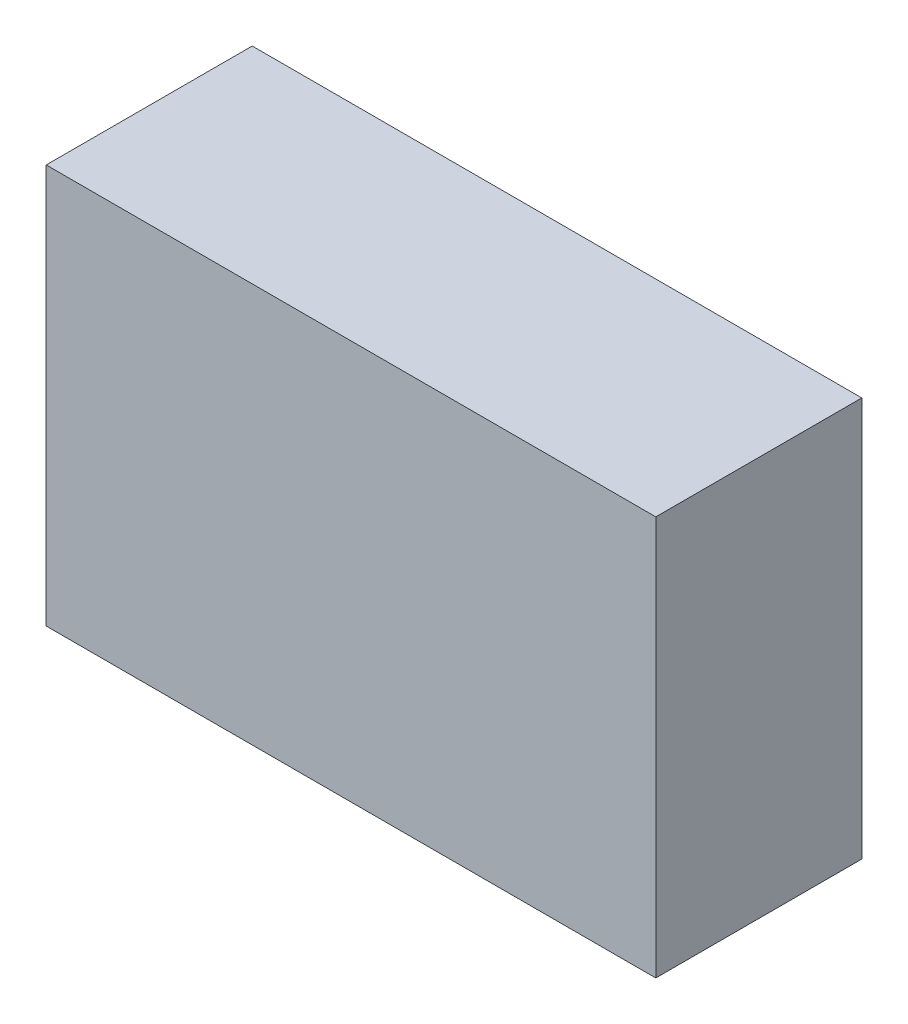
ISO-10303-21;
HEADER;
FILE_DESCRIPTION(('STEP AP214'),'2;1');
FILE_NAME('part.step','',(''),(''),'','','');
FILE_SCHEMA(('AUTOMOTIVE_DESIGN { 1 0 10303 214 1 1 1 1 }'));
ENDSEC;
DATA;
#1=APPLICATION_CONTEXT('core data for automotive mechanical design processes');
#2=APPLICATION_PROTOCOL_DEFINITION('international standard','automotive_design',2000,#1);
#3=PRODUCT_CONTEXT('',#1,'mechanical');
#4=PRODUCT('Part','Part','',(#3));
#5=PRODUCT_RELATED_PRODUCT_CATEGORY('part','',(#4));
#6=PRODUCT_DEFINITION_FORMATION('','',#4);
#7=PRODUCT_DEFINITION_CONTEXT('part definition',#1,'design');
#8=PRODUCT_DEFINITION('design','',#6,#7);
#9=PRODUCT_DEFINITION_SHAPE('','',#8);
#10=(LENGTH_UNIT() NAMED_UNIT(*) SI_UNIT(.MILLI.,.METRE.));
#11=(NAMED_UNIT(*) PLANE_ANGLE_UNIT() SI_UNIT($,.RADIAN.));
#12=(NAMED_UNIT(*) SI_UNIT($,.STERADIAN.) SOLID_ANGLE_UNIT());
#13=UNCERTAINTY_MEASURE_WITH_UNIT(LENGTH_MEASURE(1.E-05),#10,'distance_accuracy_value','');
#14=(GEOMETRIC_REPRESENTATION_CONTEXT(3) GLOBAL_UNCERTAINTY_ASSIGNED_CONTEXT((#13)) GLOBAL_UNIT_ASSIGNED_CONTEXT((#10,
#11,#12)) REPRESENTATION_CONTEXT('',''));
#15=CARTESIAN_POINT('',(0.,0.,0.));
#16=DIRECTION('',(0.,0.,1.));
#17=DIRECTION('',(1.,0.,0.));
#18=AXIS2_PLACEMENT_3D('',#15,#16,#17);
#19=CARTESIAN_POINT('',(-1.44999964,0.95000064,0.98000058));
#20=DIRECTION('',(0.,0.,1.));
#21=DIRECTION('',(1.,0.,0.));
#22=AXIS2_PLACEMENT_3D('',#19,#20,#21);
#23=PLANE('',#22);
#24=DIRECTION('',(0.,1.,0.));
#25=VECTOR('',#24,1.);
#26=CARTESIAN_POINT('',(1.44999964,0.95000064,0.98000058));
#27=LINE('',#26,#25);
#28=CARTESIAN_POINT('',(1.44999964,0.95000064,0.98000058));
#29=VERTEX_POINT('',#28);
#30=CARTESIAN_POINT('',(1.44999964,-0.95000064,0.98000058));
#31=VERTEX_POINT('',#30);
#32=EDGE_CURVE('E53',#29,#31,#27,.F.);
#33=ORIENTED_EDGE('',*,*,#32,.F.);
#34=DIRECTION('',(1.,0.,0.));
#35=VECTOR('',#34,1.);
#36=CARTESIAN_POINT('',(-1.44999964,0.95000064,0.98000058));
#37=LINE('',#36,#35);
#38=CARTESIAN_POINT('',(-1.44999964,0.95000064,0.98000058));
#39=VERTEX_POINT('',#38);
#40=EDGE_CURVE('E68',#39,#29,#37,.T.);
#41=ORIENTED_EDGE('',*,*,#40,.F.);
#42=DIRECTION('',(0.,1.,0.));
#43=VECTOR('',#42,1.);
#44=CARTESIAN_POINT('',(-1.44999964,-0.95000064,0.98000058));
#45=LINE('',#44,#43);
#46=CARTESIAN_POINT('',(-1.44999964,-0.95000064,0.98000058));
#47=VERTEX_POINT('',#46);
#48=EDGE_CURVE('E20',#47,#39,#45,.T.);
#49=ORIENTED_EDGE('',*,*,#48,.F.);
#50=DIRECTION('',(1.,0.,0.));
#51=VECTOR('',#50,1.);
#52=CARTESIAN_POINT('',(1.44999964,-0.95000064,0.98000058));
#53=LINE('',#52,#51);
#54=EDGE_CURVE('E58',#31,#47,#53,.F.);
#55=ORIENTED_EDGE('',*,*,#54,.F.);
#56=EDGE_LOOP('',(#33,#41,#49,#55));
#57=FACE_BOUND('',#56,.T.);
#58=ADVANCED_FACE('F17',(#57),#23,.T.);
#59=CARTESIAN_POINT('',(-1.44999964,-0.95000064,0.));
#60=DIRECTION('',(-1.,0.,0.));
#61=DIRECTION('',(0.,0.,1.));
#62=AXIS2_PLACEMENT_3D('',#59,#60,#61);
#63=PLANE('',#62);
#64=DIRECTION('',(0.,0.,1.));
#65=VECTOR('',#64,1.);
#66=CARTESIAN_POINT('',(-1.44999964,0.95000064,0.));
#67=LINE('',#66,#65);
#68=CARTESIAN_POINT('',(-1.44999964,0.95000064,0.));
#69=VERTEX_POINT('',#68);
#70=EDGE_CURVE('E79',#69,#39,#67,.T.);
#71=ORIENTED_EDGE('',*,*,#70,.F.);
#72=DIRECTION('',(0.,1.,0.));
#73=VECTOR('',#72,1.);
#74=CARTESIAN_POINT('',(-1.44999964,0.95000064,0.));
#75=LINE('',#74,#73);
#76=CARTESIAN_POINT('',(-1.44999964,-0.95000064,0.));
#77=VERTEX_POINT('',#76);
#78=EDGE_CURVE('E74',#69,#77,#75,.F.);
#79=ORIENTED_EDGE('',*,*,#78,.T.);
#80=DIRECTION('',(0.,0.,-1.));
#81=VECTOR('',#80,1.);
#82=CARTESIAN_POINT('',(-1.44999964,-0.95000064,0.));
#83=LINE('',#82,#81);
#84=EDGE_CURVE('E63',#47,#77,#83,.T.);
#85=ORIENTED_EDGE('',*,*,#84,.F.);
#86=ORIENTED_EDGE('',*,*,#48,.T.);
#87=EDGE_LOOP('',(#71,#79,#85,#86));
#88=FACE_BOUND('',#87,.T.);
#89=ADVANCED_FACE('F73',(#88),#63,.T.);
#90=CARTESIAN_POINT('',(1.44999964,-0.95000064,0.));
#91=DIRECTION('',(0.,-1.,0.));
#92=DIRECTION('',(0.,0.,-1.));
#93=AXIS2_PLACEMENT_3D('',#90,#91,#92);
#94=PLANE('',#93);
#95=ORIENTED_EDGE('',*,*,#84,.T.);
#96=DIRECTION('',(1.,0.,0.));
#97=VECTOR('',#96,1.);
#98=CARTESIAN_POINT('',(-1.44999964,-0.95000064,0.));
#99=LINE('',#98,#97);
#100=CARTESIAN_POINT('',(1.44999964,-0.95000064,0.));
#101=VERTEX_POINT('',#100);
#102=EDGE_CURVE('E84',#77,#101,#99,.T.);
#103=ORIENTED_EDGE('',*,*,#102,.T.);
#104=DIRECTION('',(0.,0.,-1.));
#105=VECTOR('',#104,1.);
#106=CARTESIAN_POINT('',(1.44999964,-0.95000064,0.));
#107=LINE('',#106,#105);
#108=EDGE_CURVE('E65',#31,#101,#107,.T.);
#109=ORIENTED_EDGE('',*,*,#108,.F.);
#110=ORIENTED_EDGE('',*,*,#54,.T.);
#111=EDGE_LOOP('',(#95,#103,#109,#110));
#112=FACE_BOUND('',#111,.T.);
#113=ADVANCED_FACE('F60',(#112),#94,.T.);
#114=CARTESIAN_POINT('',(1.44999964,0.95000064,0.));
#115=DIRECTION('',(1.,0.,0.));
#116=DIRECTION('',(0.,0.,-1.));
#117=AXIS2_PLACEMENT_3D('',#114,#115,#116);
#118=PLANE('',#117);
#119=ORIENTED_EDGE('',*,*,#108,.T.);
#120=DIRECTION('',(0.,1.,0.));
#121=VECTOR('',#120,1.);
#122=CARTESIAN_POINT('',(1.44999964,0.95000064,0.));
#123=LINE('',#122,#121);
#124=CARTESIAN_POINT('',(1.44999964,0.95000064,0.));
#125=VERTEX_POINT('',#124);
#126=EDGE_CURVE('E26',#101,#125,#123,.T.);
#127=ORIENTED_EDGE('',*,*,#126,.T.);
#128=DIRECTION('',(0.,0.,1.));
#129=VECTOR('',#128,1.);
#130=CARTESIAN_POINT('',(1.44999964,0.95000064,0.));
#131=LINE('',#130,#129);
#132=EDGE_CURVE('E34',#29,#125,#131,.F.);
#133=ORIENTED_EDGE('',*,*,#132,.F.);
#134=ORIENTED_EDGE('',*,*,#32,.T.);
#135=EDGE_LOOP('',(#119,#127,#133,#134));
#136=FACE_BOUND('',#135,.T.);
#137=ADVANCED_FACE('F88',(#136),#118,.T.);
#138=CARTESIAN_POINT('',(-1.44999964,0.95000064,0.));
#139=DIRECTION('',(0.,1.,0.));
#140=DIRECTION('',(0.,0.,1.));
#141=AXIS2_PLACEMENT_3D('',#138,#139,#140);
#142=PLANE('',#141);
#143=ORIENTED_EDGE('',*,*,#132,.T.);
#144=DIRECTION('',(1.,0.,0.));
#145=VECTOR('',#144,1.);
#146=CARTESIAN_POINT('',(-1.44999964,0.95000064,0.));
#147=LINE('',#146,#145);
#148=EDGE_CURVE('E11',#125,#69,#147,.F.);
#149=ORIENTED_EDGE('',*,*,#148,.T.);
#150=ORIENTED_EDGE('',*,*,#70,.T.);
#151=ORIENTED_EDGE('',*,*,#40,.T.);
#152=EDGE_LOOP('',(#143,#149,#150,#151));
#153=FACE_BOUND('',#152,.T.);
#154=ADVANCED_FACE('F91',(#153),#142,.T.);
#155=CARTESIAN_POINT('',(-1.44999964,0.95000064,0.));
#156=DIRECTION('',(0.,0.,1.));
#157=DIRECTION('',(1.,0.,0.));
#158=AXIS2_PLACEMENT_3D('',#155,#156,#157);
#159=PLANE('',#158);
#160=ORIENTED_EDGE('',*,*,#126,.F.);
#161=ORIENTED_EDGE('',*,*,#102,.F.);
#162=ORIENTED_EDGE('',*,*,#78,.F.);
#163=ORIENTED_EDGE('',*,*,#148,.F.);
#164=EDGE_LOOP('',(#160,#161,#162,#163));
#165=FACE_BOUND('',#164,.T.);
#166=ADVANCED_FACE('F90',(#165),#159,.F.);
#167=CLOSED_SHELL('',(#58,#89,#113,#137,#154,#166));
#168=MANIFOLD_SOLID_BREP('B1',#167);
#169=ADVANCED_BREP_SHAPE_REPRESENTATION('',(#18,#168),#14);
#170=SHAPE_DEFINITION_REPRESENTATION(#9,#169);
ENDSEC;
END-ISO-10303-21;
